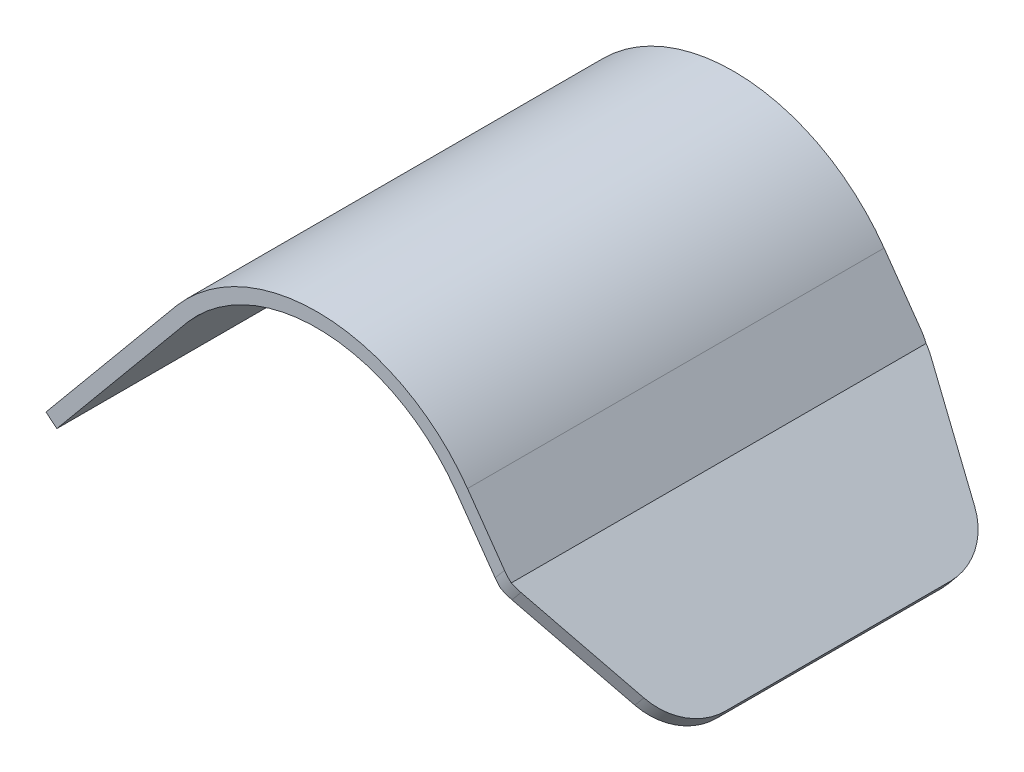
ISO-10303-21;
HEADER;
FILE_DESCRIPTION(('STEP AP214'),'2;1');
FILE_NAME('part.step','',(''),(''),'','','');
FILE_SCHEMA(('AUTOMOTIVE_DESIGN { 1 0 10303 214 1 1 1 1 }'));
ENDSEC;
DATA;
#1=APPLICATION_CONTEXT('core data for automotive mechanical design processes');
#2=APPLICATION_PROTOCOL_DEFINITION('international standard','automotive_design',2000,#1);
#3=PRODUCT_CONTEXT('',#1,'mechanical');
#4=PRODUCT('Part','Part','',(#3));
#5=PRODUCT_RELATED_PRODUCT_CATEGORY('part','',(#4));
#6=PRODUCT_DEFINITION_FORMATION('','',#4);
#7=PRODUCT_DEFINITION_CONTEXT('part definition',#1,'design');
#8=PRODUCT_DEFINITION('design','',#6,#7);
#9=PRODUCT_DEFINITION_SHAPE('','',#8);
#10=(LENGTH_UNIT() NAMED_UNIT(*) SI_UNIT(.MILLI.,.METRE.));
#11=(NAMED_UNIT(*) PLANE_ANGLE_UNIT() SI_UNIT($,.RADIAN.));
#12=(NAMED_UNIT(*) SI_UNIT($,.STERADIAN.) SOLID_ANGLE_UNIT());
#13=UNCERTAINTY_MEASURE_WITH_UNIT(LENGTH_MEASURE(1.E-05),#10,'distance_accuracy_value','');
#14=(GEOMETRIC_REPRESENTATION_CONTEXT(3) GLOBAL_UNCERTAINTY_ASSIGNED_CONTEXT((#13)) GLOBAL_UNIT_ASSIGNED_CONTEXT((#10,
#11,#12)) REPRESENTATION_CONTEXT('',''));
#15=CARTESIAN_POINT('',(0.,0.,0.));
#16=DIRECTION('',(0.,0.,1.));
#17=DIRECTION('',(1.,0.,0.));
#18=AXIS2_PLACEMENT_3D('',#15,#16,#17);
#19=CARTESIAN_POINT('',(98.2846711056519,73.4666673466549,-37.));
#20=DIRECTION('',(0.,0.,1.));
#21=DIRECTION('',(1.,0.,0.));
#22=AXIS2_PLACEMENT_3D('',#19,#20,#21);
#23=CYLINDRICAL_SURFACE('',#22,30.2286703263176);
#24=DIRECTION('',(0.,0.,1.));
#25=VECTOR('',#24,1.);
#26=CARTESIAN_POINT('',(122.974907994075,90.9069859243292,-37.));
#27=LINE('',#26,#25);
#28=CARTESIAN_POINT('',(122.974907994075,90.9069859243292,-37.));
#29=VERTEX_POINT('',#28);
#30=CARTESIAN_POINT('',(122.974907994075,90.9069859243292,37.));
#31=VERTEX_POINT('',#30);
#32=EDGE_CURVE('E420',#29,#31,#27,.T.);
#33=ORIENTED_EDGE('',*,*,#32,.T.);
#34=CARTESIAN_POINT('',(98.2846711056519,73.4666673466549,37.));
#35=DIRECTION('',(0.,0.,1.));
#36=DIRECTION('',(1.,0.,0.));
#37=AXIS2_PLACEMENT_3D('',#34,#35,#36);
#38=CIRCLE('',#37,30.2286703263176);
#39=CARTESIAN_POINT('',(75.3095561726378,93.1114275516558,37.));
#40=VERTEX_POINT('',#39);
#41=EDGE_CURVE('E385',#40,#31,#38,.F.);
#42=ORIENTED_EDGE('',*,*,#41,.F.);
#43=DIRECTION('',(0.,0.,1.));
#44=VECTOR('',#43,1.);
#45=CARTESIAN_POINT('',(75.3095561726378,93.1114275516558,-37.));
#46=LINE('',#45,#44);
#47=CARTESIAN_POINT('',(75.3095561726379,93.1114275516558,-37.));
#48=VERTEX_POINT('',#47);
#49=EDGE_CURVE('E263',#40,#48,#46,.F.);
#50=ORIENTED_EDGE('',*,*,#49,.T.);
#51=CARTESIAN_POINT('',(98.2846711056519,73.4666673466549,-37.));
#52=DIRECTION('',(0.,0.,1.));
#53=DIRECTION('',(1.,0.,0.));
#54=AXIS2_PLACEMENT_3D('',#51,#52,#53);
#55=CIRCLE('',#54,30.2286703263176);
#56=EDGE_CURVE('E272',#48,#29,#55,.F.);
#57=ORIENTED_EDGE('',*,*,#56,.T.);
#58=EDGE_LOOP('',(#33,#42,#50,#57));
#59=FACE_BOUND('',#58,.T.);
#60=ADVANCED_FACE('F112',(#59),#23,.F.);
#61=CARTESIAN_POINT('',(98.2846711056519,73.4666673466549,-37.));
#62=DIRECTION('',(0.,0.,-1.));
#63=DIRECTION('',(-1.,0.,0.));
#64=AXIS2_PLACEMENT_3D('',#61,#62,#63);
#65=PLANE('',#64);
#66=DIRECTION('',(0.576946269531751,-0.816782101954613,0.));
#67=VECTOR('',#66,1.);
#68=CARTESIAN_POINT('',(125.016863248961,92.3493515981586,-37.));
#69=LINE('',#68,#67);
#70=CARTESIAN_POINT('',(125.016863248961,92.3493515981586,-37.));
#71=VERTEX_POINT('',#70);
#72=CARTESIAN_POINT('',(131.584676674904,83.0513064619262,-37.));
#73=VERTEX_POINT('',#72);
#74=EDGE_CURVE('E267',#71,#73,#69,.T.);
#75=ORIENTED_EDGE('',*,*,#74,.T.);
#76=DIRECTION('',(0.638552902804792,0.769577929984725,0.));
#77=VECTOR('',#76,1.);
#78=CARTESIAN_POINT('',(129.685244994592,80.7621293330441,-37.));
#79=LINE('',#78,#77);
#80=CARTESIAN_POINT('',(129.931360316438,81.0587451953984,-37.));
#81=VERTEX_POINT('',#80);
#82=EDGE_CURVE('E329',#73,#81,#79,.F.);
#83=ORIENTED_EDGE('',*,*,#82,.T.);
#84=DIRECTION('',(0.576946269531751,-0.816782101954613,0.));
#85=VECTOR('',#84,1.);
#86=CARTESIAN_POINT('',(122.974907994075,90.9069859243292,-37.));
#87=LINE('',#86,#85);
#88=EDGE_CURVE('E435',#29,#81,#87,.T.);
#89=ORIENTED_EDGE('',*,*,#88,.F.);
#90=ORIENTED_EDGE('',*,*,#56,.F.);
#91=DIRECTION('',(0.638552902804786,0.76957792998473,0.));
#92=VECTOR('',#91,1.);
#93=CARTESIAN_POINT('',(52.0598583226345,65.0911111995023,-37.));
#94=LINE('',#93,#92);
#95=CARTESIAN_POINT('',(52.0598583226345,65.0911111995023,-37.));
#96=VERTEX_POINT('',#95);
#97=EDGE_CURVE('E253',#96,#48,#94,.T.);
#98=ORIENTED_EDGE('',*,*,#97,.F.);
#99=DIRECTION('',(-0.769577929984731,0.638552902804785,0.));
#100=VECTOR('',#99,1.);
#101=CARTESIAN_POINT('',(52.0598583226345,65.0911111995023,-37.));
#102=LINE('',#101,#100);
#103=CARTESIAN_POINT('',(50.1359134976727,66.6874934565142,-37.));
#104=VERTEX_POINT('',#103);
#105=EDGE_CURVE('E235',#96,#104,#102,.T.);
#106=ORIENTED_EDGE('',*,*,#105,.T.);
#107=DIRECTION('',(0.638552902804786,0.76957792998473,0.));
#108=VECTOR('',#107,1.);
#109=CARTESIAN_POINT('',(50.1359134976727,66.6874934565142,-37.));
#110=LINE('',#109,#108);
#111=CARTESIAN_POINT('',(72.8027229224496,94.005318181541,-37.));
#112=VERTEX_POINT('',#111);
#113=EDGE_CURVE('E250',#104,#112,#110,.T.);
#114=ORIENTED_EDGE('',*,*,#113,.T.);
#115=CARTESIAN_POINT('',(72.8027229224496,94.0053181815411,-37.));
#116=DIRECTION('',(0.638552902804781,0.769577929984734,0.));
#117=VECTOR('',#116,1.);
#118=LINE('',#115,#117);
#119=CARTESIAN_POINT('',(73.3971896058036,94.7217638160546,-37.));
#120=VERTEX_POINT('',#119);
#121=EDGE_CURVE('E282',#112,#120,#118,.T.);
#122=ORIENTED_EDGE('',*,*,#121,.T.);
#123=CARTESIAN_POINT('',(98.2846711056519,73.4666673466549,-37.));
#124=DIRECTION('',(0.,0.,-1.));
#125=DIRECTION('',(1.,0.,0.));
#126=AXIS2_PLACEMENT_3D('',#123,#124,#125);
#127=CIRCLE('',#126,32.7286703263176);
#128=EDGE_CURVE('E269',#120,#71,#127,.T.);
#129=ORIENTED_EDGE('',*,*,#128,.T.);
#130=EDGE_LOOP('',(#75,#83,#89,#90,#98,#106,#114,#122,#129));
#131=FACE_BOUND('',#130,.T.);
#132=ADVANCED_FACE('F249',(#131),#65,.T.);
#133=CARTESIAN_POINT('',(152.209243945667,62.0729695318179,-37.));
#134=DIRECTION('',(-0.638552902804792,-0.769577929984725,0.));
#135=DIRECTION('',(0.769577929984725,-0.638552902804792,0.));
#136=AXIS2_PLACEMENT_3D('',#133,#134,#135);
#137=PLANE('',#136);
#138=DIRECTION('',(0.,0.,1.));
#139=VECTOR('',#138,1.);
#140=CARTESIAN_POINT('',(130.786083181693,79.8487151192221,-37.));
#141=LINE('',#140,#139);
#142=CARTESIAN_POINT('',(130.786083181693,79.848715119222,-36.8971627126065));
#143=VERTEX_POINT('',#142);
#144=CARTESIAN_POINT('',(130.786083181693,79.8487151192221,36.8971627126065));
#145=VERTEX_POINT('',#144);
#146=EDGE_CURVE('E377',#143,#145,#141,.T.);
#147=ORIENTED_EDGE('',*,*,#146,.F.);
#148=CARTESIAN_POINT('',(129.685244994592,80.7621293330441,-27.));
#149=DIRECTION('',(-0.638552902804792,-0.769577929984725,0.));
#150=DIRECTION('',(0.769577929984725,-0.638552902804792,0.));
#151=AXIS2_PLACEMENT_3D('',#148,#149,#150);
#152=CIRCLE('',#151,10.);
#153=CARTESIAN_POINT('',(132.314663472216,78.5803843321068,-36.398199147731));
#154=VERTEX_POINT('',#153);
#155=EDGE_CURVE('E340',#143,#154,#152,.T.);
#156=ORIENTED_EDGE('',*,*,#155,.T.);
#157=DIRECTION('',(-0.7232646645695,0.600124734692113,-0.341670203260234));
#158=VECTOR('',#157,1.);
#159=CARTESIAN_POINT('',(149.738064096123,64.1234169326554,-28.1673852779589));
#160=LINE('',#159,#158);
#161=CARTESIAN_POINT('',(147.142883123444,66.2767535589286,-29.3933486823234));
#162=VERTEX_POINT('',#161);
#163=EDGE_CURVE('E366',#162,#154,#160,.T.);
#164=ORIENTED_EDGE('',*,*,#163,.F.);
#165=CARTESIAN_POINT('',(144.51346464582,68.4584985598659,-19.9951495345924));
#166=DIRECTION('',(-0.638552902804792,-0.769577929984725,0.));
#167=DIRECTION('',(0.769577929984725,-0.638552902804792,0.));
#168=AXIS2_PLACEMENT_3D('',#165,#166,#167);
#169=CIRCLE('',#168,10.);
#170=CARTESIAN_POINT('',(152.209243945667,62.0729695318179,-19.9951495345924));
#171=VERTEX_POINT('',#170);
#172=EDGE_CURVE('E133',#162,#171,#169,.T.);
#173=ORIENTED_EDGE('',*,*,#172,.T.);
#174=DIRECTION('',(0.,0.,1.));
#175=VECTOR('',#174,1.);
#176=CARTESIAN_POINT('',(152.209243945667,62.0729695318179,-37.));
#177=LINE('',#176,#175);
#178=CARTESIAN_POINT('',(152.209243945667,62.0729695318179,19.9951495345924));
#179=VERTEX_POINT('',#178);
#180=EDGE_CURVE('E434',#171,#179,#177,.T.);
#181=ORIENTED_EDGE('',*,*,#180,.T.);
#182=CARTESIAN_POINT('',(144.51346464582,68.4584985598659,19.9951495345924));
#183=DIRECTION('',(-0.638552902804792,-0.769577929984725,0.));
#184=DIRECTION('',(0.769577929984725,-0.638552902804792,0.));
#185=AXIS2_PLACEMENT_3D('',#182,#183,#184);
#186=CIRCLE('',#185,10.);
#187=CARTESIAN_POINT('',(147.142883123444,66.2767535589286,29.3933486823234));
#188=VERTEX_POINT('',#187);
#189=EDGE_CURVE('E335',#179,#188,#186,.T.);
#190=ORIENTED_EDGE('',*,*,#189,.T.);
#191=DIRECTION('',(0.7232646645695,-0.600124734692113,-0.341670203260234));
#192=VECTOR('',#191,1.);
#193=CARTESIAN_POINT('',(168.024794982749,48.9501061664581,19.5287342210631));
#194=LINE('',#193,#192);
#195=CARTESIAN_POINT('',(132.314663472216,78.5803843321068,36.398199147731));
#196=VERTEX_POINT('',#195);
#197=EDGE_CURVE('E355',#196,#188,#194,.T.);
#198=ORIENTED_EDGE('',*,*,#197,.F.);
#199=CARTESIAN_POINT('',(129.685244994592,80.7621293330441,27.));
#200=DIRECTION('',(-0.638552902804792,-0.769577929984725,0.));
#201=DIRECTION('',(0.769577929984725,-0.638552902804792,0.));
#202=AXIS2_PLACEMENT_3D('',#199,#200,#201);
#203=CIRCLE('',#202,10.);
#204=EDGE_CURVE('E338',#196,#145,#203,.T.);
#205=ORIENTED_EDGE('',*,*,#204,.T.);
#206=EDGE_LOOP('',(#147,#156,#164,#173,#181,#190,#198,#205));
#207=FACE_BOUND('',#206,.T.);
#208=ADVANCED_FACE('F363',(#207),#137,.T.);
#209=CARTESIAN_POINT('',(122.974907994075,90.9069859243292,-37.));
#210=DIRECTION('',(-0.816782101954613,-0.576946269531751,0.));
#211=DIRECTION('',(0.576946269531751,-0.816782101954613,0.));
#212=AXIS2_PLACEMENT_3D('',#209,#210,#211);
#213=PLANE('',#212);
#214=ORIENTED_EDGE('',*,*,#88,.T.);
#215=CARTESIAN_POINT('',(129.931360316438,81.0587451953984,-27.));
#216=DIRECTION('',(-0.816782101954613,-0.576946269531751,0.));
#217=DIRECTION('',(0.576946269531751,-0.816782101954613,0.));
#218=AXIS2_PLACEMENT_3D('',#215,#216,#217);
#219=ELLIPSE('',#218,10.3566445392597,10.);
#220=EDGE_CURVE('E333',#81,#143,#219,.T.);
#221=ORIENTED_EDGE('',*,*,#220,.T.);
#222=ORIENTED_EDGE('',*,*,#146,.T.);
#223=CARTESIAN_POINT('',(129.931360316438,81.0587451953984,27.));
#224=DIRECTION('',(-0.816782101954613,-0.576946269531751,0.));
#225=DIRECTION('',(-0.576946269531751,0.816782101954613,0.));
#226=AXIS2_PLACEMENT_3D('',#223,#224,#225);
#227=ELLIPSE('',#226,10.3566445392597,10.);
#228=CARTESIAN_POINT('',(129.931360316438,81.0587451953984,37.));
#229=VERTEX_POINT('',#228);
#230=EDGE_CURVE('E331',#145,#229,#227,.T.);
#231=ORIENTED_EDGE('',*,*,#230,.T.);
#232=DIRECTION('',(0.576946269531751,-0.816782101954613,0.));
#233=VECTOR('',#232,1.);
#234=CARTESIAN_POINT('',(122.974907994075,90.9069859243292,37.));
#235=LINE('',#234,#233);
#236=EDGE_CURVE('E376',#31,#229,#235,.T.);
#237=ORIENTED_EDGE('',*,*,#236,.F.);
#238=ORIENTED_EDGE('',*,*,#32,.F.);
#239=EDGE_LOOP('',(#214,#221,#222,#231,#237,#238));
#240=FACE_BOUND('',#239,.T.);
#241=ADVANCED_FACE('F300',(#240),#213,.T.);
#242=CARTESIAN_POINT('',(98.2846711056519,73.4666673466549,-37.));
#243=DIRECTION('',(0.,0.,1.));
#244=DIRECTION('',(1.,0.,0.));
#245=AXIS2_PLACEMENT_3D('',#242,#243,#244);
#246=CYLINDRICAL_SURFACE('',#245,32.7286703263176);
#247=ORIENTED_EDGE('',*,*,#128,.F.);
#248=ORIENTED_EDGE('',*,*,#121,.F.);
#249=DIRECTION('',(0.,0.,1.));
#250=VECTOR('',#249,1.);
#251=CARTESIAN_POINT('',(72.8027229224496,94.0053181815411,-37.));
#252=LINE('',#251,#250);
#253=CARTESIAN_POINT('',(72.8027229224496,94.0053181815411,37.));
#254=VERTEX_POINT('',#253);
#255=EDGE_CURVE('E257',#112,#254,#252,.T.);
#256=ORIENTED_EDGE('',*,*,#255,.T.);
#257=CARTESIAN_POINT('',(98.2846711056519,73.4666673466549,37.));
#258=DIRECTION('',(0.,0.,-1.));
#259=DIRECTION('',(-0.778581834493654,0.62754308776091,0.));
#260=AXIS2_PLACEMENT_3D('',#257,#258,#259);
#261=CIRCLE('',#260,32.7286703263176);
#262=CARTESIAN_POINT('',(73.3971896058036,94.7217638160546,37.));
#263=VERTEX_POINT('',#262);
#264=EDGE_CURVE('E386',#254,#263,#261,.T.);
#265=ORIENTED_EDGE('',*,*,#264,.T.);
#266=CARTESIAN_POINT('',(98.2846711056519,73.4666673466549,37.));
#267=DIRECTION('',(0.,0.,-1.));
#268=DIRECTION('',(1.,0.,0.));
#269=AXIS2_PLACEMENT_3D('',#266,#267,#268);
#270=CIRCLE('',#269,32.7286703263176);
#271=CARTESIAN_POINT('',(125.016863248961,92.3493515981586,37.));
#272=VERTEX_POINT('',#271);
#273=EDGE_CURVE('E388',#263,#272,#270,.T.);
#274=ORIENTED_EDGE('',*,*,#273,.T.);
#275=DIRECTION('',(0.,0.,1.));
#276=VECTOR('',#275,1.);
#277=CARTESIAN_POINT('',(125.016863248961,92.3493515981586,-37.));
#278=LINE('',#277,#276);
#279=EDGE_CURVE('E421',#71,#272,#278,.T.);
#280=ORIENTED_EDGE('',*,*,#279,.F.);
#281=EDGE_LOOP('',(#247,#248,#256,#265,#274,#280));
#282=FACE_BOUND('',#281,.T.);
#283=ADVANCED_FACE('F289',(#282),#246,.T.);
#284=CARTESIAN_POINT('',(125.016863248961,92.3493515981586,-37.));
#285=DIRECTION('',(-0.816782101954613,-0.576946269531751,0.));
#286=DIRECTION('',(0.576946269531751,-0.816782101954613,0.));
#287=AXIS2_PLACEMENT_3D('',#284,#285,#286);
#288=PLANE('',#287);
#289=DIRECTION('',(0.,0.,1.));
#290=VECTOR('',#289,1.);
#291=CARTESIAN_POINT('',(132.63712342813,81.5613589283489,-37.));
#292=LINE('',#291,#290);
#293=CARTESIAN_POINT('',(132.63712342813,81.5613589283489,-36.8436601814366));
#294=VERTEX_POINT('',#293);
#295=CARTESIAN_POINT('',(132.63712342813,81.5613589283489,36.8436601814366));
#296=VERTEX_POINT('',#295);
#297=EDGE_CURVE('E423',#294,#296,#292,.T.);
#298=ORIENTED_EDGE('',*,*,#297,.F.);
#299=CARTESIAN_POINT('',(131.584676674904,83.0513064619262,-27.));
#300=DIRECTION('',(-0.816782101954613,-0.576946269531751,0.));
#301=DIRECTION('',(0.576946269531751,-0.816782101954613,0.));
#302=AXIS2_PLACEMENT_3D('',#299,#300,#301);
#303=ELLIPSE('',#302,10.3566445392597,10.);
#304=EDGE_CURVE('E327',#294,#73,#303,.F.);
#305=ORIENTED_EDGE('',*,*,#304,.T.);
#306=ORIENTED_EDGE('',*,*,#74,.F.);
#307=ORIENTED_EDGE('',*,*,#279,.T.);
#308=DIRECTION('',(0.576946269531751,-0.816782101954613,0.));
#309=VECTOR('',#308,1.);
#310=CARTESIAN_POINT('',(125.016863248961,92.3493515981586,37.));
#311=LINE('',#310,#309);
#312=CARTESIAN_POINT('',(131.584676674904,83.0513064619262,37.));
#313=VERTEX_POINT('',#312);
#314=EDGE_CURVE('E243',#272,#313,#311,.T.);
#315=ORIENTED_EDGE('',*,*,#314,.T.);
#316=CARTESIAN_POINT('',(131.584676674904,83.0513064619262,27.));
#317=DIRECTION('',(-0.816782101954613,-0.576946269531751,0.));
#318=DIRECTION('',(-0.576946269531751,0.816782101954613,0.));
#319=AXIS2_PLACEMENT_3D('',#316,#317,#318);
#320=ELLIPSE('',#319,10.3566445392597,10.);
#321=EDGE_CURVE('E325',#313,#296,#320,.F.);
#322=ORIENTED_EDGE('',*,*,#321,.T.);
#323=EDGE_LOOP('',(#298,#305,#306,#307,#315,#322));
#324=FACE_BOUND('',#323,.T.);
#325=ADVANCED_FACE('F299',(#324),#288,.F.);
#326=CARTESIAN_POINT('',(153.805626202679,63.9969143567798,-37.));
#327=DIRECTION('',(-0.638552902804792,-0.769577929984725,0.));
#328=DIRECTION('',(0.769577929984725,-0.638552902804792,0.));
#329=AXIS2_PLACEMENT_3D('',#326,#327,#328);
#330=PLANE('',#329);
#331=DIRECTION('',(0.7232646645695,-0.600124734692113,0.341670203260233));
#332=VECTOR('',#331,1.);
#333=CARTESIAN_POINT('',(132.63712342813,81.5613589283489,-37.));
#334=LINE('',#333,#332);
#335=CARTESIAN_POINT('',(133.911045729228,80.5043291570686,-36.398199147731));
#336=VERTEX_POINT('',#335);
#337=CARTESIAN_POINT('',(148.739265380456,68.2006983838904,-29.3933486823234));
#338=VERTEX_POINT('',#337);
#339=EDGE_CURVE('E455',#336,#338,#334,.T.);
#340=ORIENTED_EDGE('',*,*,#339,.F.);
#341=CARTESIAN_POINT('',(131.281627251604,82.6860741580059,-27.));
#342=DIRECTION('',(-0.638552902804792,-0.769577929984725,0.));
#343=DIRECTION('',(0.769577929984725,-0.638552902804792,0.));
#344=AXIS2_PLACEMENT_3D('',#341,#342,#343);
#345=CIRCLE('',#344,10.);
#346=EDGE_CURVE('E323',#336,#294,#345,.F.);
#347=ORIENTED_EDGE('',*,*,#346,.T.);
#348=ORIENTED_EDGE('',*,*,#297,.T.);
#349=CARTESIAN_POINT('',(131.281627251604,82.6860741580059,27.));
#350=DIRECTION('',(-0.638552902804792,-0.769577929984725,0.));
#351=DIRECTION('',(0.769577929984725,-0.638552902804792,0.));
#352=AXIS2_PLACEMENT_3D('',#349,#350,#351);
#353=CIRCLE('',#352,10.);
#354=CARTESIAN_POINT('',(133.911045729228,80.5043291570686,36.398199147731));
#355=VERTEX_POINT('',#354);
#356=EDGE_CURVE('E321',#296,#355,#353,.F.);
#357=ORIENTED_EDGE('',*,*,#356,.T.);
#358=DIRECTION('',(-0.7232646645695,0.600124734692113,0.341670203260233));
#359=VECTOR('',#358,1.);
#360=CARTESIAN_POINT('',(132.63712342813,81.5613589283489,37.));
#361=LINE('',#360,#359);
#362=CARTESIAN_POINT('',(148.739265380456,68.2006983838904,29.3933486823234));
#363=VERTEX_POINT('',#362);
#364=EDGE_CURVE('E358',#363,#355,#361,.T.);
#365=ORIENTED_EDGE('',*,*,#364,.F.);
#366=CARTESIAN_POINT('',(146.109846902832,70.3824433848277,19.9951495345924));
#367=DIRECTION('',(-0.638552902804792,-0.769577929984725,0.));
#368=DIRECTION('',(0.769577929984725,-0.638552902804792,0.));
#369=AXIS2_PLACEMENT_3D('',#366,#367,#368);
#370=CIRCLE('',#369,10.);
#371=CARTESIAN_POINT('',(153.805626202679,63.9969143567798,19.9951495345924));
#372=VERTEX_POINT('',#371);
#373=EDGE_CURVE('E317',#363,#372,#370,.F.);
#374=ORIENTED_EDGE('',*,*,#373,.T.);
#375=DIRECTION('',(0.,0.,1.));
#376=VECTOR('',#375,1.);
#377=CARTESIAN_POINT('',(153.805626202679,63.9969143567798,-37.));
#378=LINE('',#377,#376);
#379=CARTESIAN_POINT('',(153.805626202679,63.9969143567798,-19.9951495345924));
#380=VERTEX_POINT('',#379);
#381=EDGE_CURVE('E430',#380,#372,#378,.T.);
#382=ORIENTED_EDGE('',*,*,#381,.F.);
#383=CARTESIAN_POINT('',(146.109846902832,70.3824433848277,-19.9951495345924));
#384=DIRECTION('',(-0.638552902804792,-0.769577929984725,0.));
#385=DIRECTION('',(0.769577929984725,-0.638552902804792,0.));
#386=AXIS2_PLACEMENT_3D('',#383,#384,#385);
#387=CIRCLE('',#386,10.);
#388=EDGE_CURVE('E319',#380,#338,#387,.F.);
#389=ORIENTED_EDGE('',*,*,#388,.T.);
#390=EDGE_LOOP('',(#340,#347,#348,#357,#365,#374,#382,#389));
#391=FACE_BOUND('',#390,.T.);
#392=ADVANCED_FACE('F454',(#391),#330,.F.);
#393=CARTESIAN_POINT('',(153.805626202679,63.9969143567798,-37.));
#394=DIRECTION('',(-0.769577929984726,0.638552902804791,0.));
#395=DIRECTION('',(-0.638552902804791,-0.769577929984726,0.));
#396=AXIS2_PLACEMENT_3D('',#393,#394,#395);
#397=PLANE('',#396);
#398=ORIENTED_EDGE('',*,*,#180,.F.);
#399=DIRECTION('',(0.638552902804791,0.769577929984726,0.));
#400=VECTOR('',#399,1.);
#401=CARTESIAN_POINT('',(153.805626202679,63.9969143567798,-19.9951495345924));
#402=LINE('',#401,#400);
#403=EDGE_CURVE('E12',#171,#380,#402,.T.);
#404=ORIENTED_EDGE('',*,*,#403,.T.);
#405=ORIENTED_EDGE('',*,*,#381,.T.);
#406=DIRECTION('',(0.638552902804791,0.769577929984726,0.));
#407=VECTOR('',#406,1.);
#408=CARTESIAN_POINT('',(153.805626202679,63.9969143567797,19.9951495345924));
#409=LINE('',#408,#407);
#410=EDGE_CURVE('E120',#372,#179,#409,.F.);
#411=ORIENTED_EDGE('',*,*,#410,.T.);
#412=EDGE_LOOP('',(#398,#404,#405,#411));
#413=FACE_BOUND('',#412,.T.);
#414=ADVANCED_FACE('F541',(#413),#397,.F.);
#415=CARTESIAN_POINT('',(50.1359134976727,66.6874934565142,37.));
#416=DIRECTION('',(-0.76957792998473,0.638552902804786,0.));
#417=DIRECTION('',(-0.638552902804786,-0.76957792998473,0.));
#418=AXIS2_PLACEMENT_3D('',#415,#416,#417);
#419=PLANE('',#418);
#420=CARTESIAN_POINT('',(58.1808907012102,76.3832240308774,-1.55338666496028));
#421=DIRECTION('',(-0.76957792998473,0.638552902804786,0.));
#422=DIRECTION('',(-0.638552902804786,-0.76957792998473,0.));
#423=AXIS2_PLACEMENT_3D('',#420,#421,#422);
#424=CIRCLE('',#423,1.70000000000001);
#425=CARTESIAN_POINT('',(57.095350766442,75.0749415499034,-1.55338666496028));
#426=VERTEX_POINT('',#425);
#427=EDGE_CURVE('E259',#426,#426,#424,.T.);
#428=ORIENTED_EDGE('',*,*,#427,.F.);
#429=EDGE_LOOP('',(#428));
#430=FACE_BOUND('',#429,.T.);
#431=CARTESIAN_POINT('',(61.8353722373306,80.7875706768354,-9.45700491751469));
#432=DIRECTION('',(-0.76957792998473,0.638552902804786,0.));
#433=DIRECTION('',(-0.638552902804786,-0.76957792998473,0.));
#434=AXIS2_PLACEMENT_3D('',#431,#432,#433);
#435=CIRCLE('',#434,1.69999999999999);
#436=CARTESIAN_POINT('',(60.7498323025624,79.4792881958613,-9.45700491751469));
#437=VERTEX_POINT('',#436);
#438=EDGE_CURVE('E489',#437,#437,#435,.T.);
#439=ORIENTED_EDGE('',*,*,#438,.F.);
#440=EDGE_LOOP('',(#439));
#441=FACE_BOUND('',#440,.T.);
#442=CARTESIAN_POINT('',(65.1296341076054,84.7577839822923,-1.45229617633346));
#443=DIRECTION('',(-0.76957792998473,0.638552902804786,0.));
#444=DIRECTION('',(-0.638552902804786,-0.76957792998473,0.));
#445=AXIS2_PLACEMENT_3D('',#442,#443,#444);
#446=CIRCLE('',#445,1.69999999999999);
#447=CARTESIAN_POINT('',(64.0440941728372,83.4495015013183,-1.45229617633346));
#448=VERTEX_POINT('',#447);
#449=EDGE_CURVE('E486',#448,#448,#446,.T.);
#450=ORIENTED_EDGE('',*,*,#449,.F.);
#451=EDGE_LOOP('',(#450));
#452=FACE_BOUND('',#451,.T.);
#453=CARTESIAN_POINT('',(61.5167554021311,80.4035766750634,6.55241256484776));
#454=DIRECTION('',(-0.76957792998473,0.638552902804786,0.));
#455=DIRECTION('',(-0.638552902804786,-0.76957792998473,0.));
#456=AXIS2_PLACEMENT_3D('',#453,#454,#455);
#457=CIRCLE('',#456,1.69999999999999);
#458=CARTESIAN_POINT('',(60.431215467363,79.0952941940894,6.55241256484776));
#459=VERTEX_POINT('',#458);
#460=EDGE_CURVE('E483',#459,#459,#457,.T.);
#461=ORIENTED_EDGE('',*,*,#460,.F.);
#462=EDGE_LOOP('',(#461));
#463=FACE_BOUND('',#462,.T.);
#464=CARTESIAN_POINT('',(54.8450260002892,72.3628713866914,-9.65918589476832));
#465=DIRECTION('',(-0.76957792998473,0.638552902804786,0.));
#466=DIRECTION('',(-0.638552902804786,-0.76957792998473,0.));
#467=AXIS2_PLACEMENT_3D('',#464,#465,#466);
#468=CIRCLE('',#467,1.70000000000001);
#469=CARTESIAN_POINT('',(53.7594860655211,71.0545889057174,-9.65918589476832));
#470=VERTEX_POINT('',#469);
#471=EDGE_CURVE('E480',#470,#470,#468,.T.);
#472=ORIENTED_EDGE('',*,*,#471,.F.);
#473=EDGE_LOOP('',(#472));
#474=FACE_BOUND('',#473,.T.);
#475=CARTESIAN_POINT('',(68.4238959778802,88.7279972877493,6.55241256484777));
#476=DIRECTION('',(-0.76957792998473,0.638552902804786,0.));
#477=DIRECTION('',(-0.638552902804786,-0.76957792998473,0.));
#478=AXIS2_PLACEMENT_3D('',#475,#476,#477);
#479=CIRCLE('',#478,1.70000000000001);
#480=CARTESIAN_POINT('',(67.3383560431121,87.4197148067752,6.55241256484777));
#481=VERTEX_POINT('',#480);
#482=EDGE_CURVE('E477',#481,#481,#479,.T.);
#483=ORIENTED_EDGE('',*,*,#482,.F.);
#484=EDGE_LOOP('',(#483));
#485=FACE_BOUND('',#484,.T.);
#486=ORIENTED_EDGE('',*,*,#255,.F.);
#487=ORIENTED_EDGE('',*,*,#113,.F.);
#488=DIRECTION('',(0.,0.,-1.));
#489=VECTOR('',#488,1.);
#490=CARTESIAN_POINT('',(50.1359134976727,66.6874934565142,37.));
#491=LINE('',#490,#489);
#492=CARTESIAN_POINT('',(50.1359134976727,66.6874934565142,37.));
#493=VERTEX_POINT('',#492);
#494=EDGE_CURVE('E232',#493,#104,#491,.T.);
#495=ORIENTED_EDGE('',*,*,#494,.F.);
#496=DIRECTION('',(0.638552902804786,0.76957792998473,0.));
#497=VECTOR('',#496,1.);
#498=CARTESIAN_POINT('',(50.1359134976727,66.6874934565142,37.));
#499=LINE('',#498,#497);
#500=EDGE_CURVE('E495',#493,#254,#499,.T.);
#501=ORIENTED_EDGE('',*,*,#500,.T.);
#502=EDGE_LOOP('',(#486,#487,#495,#501));
#503=FACE_BOUND('',#502,.T.);
#504=ADVANCED_FACE('F256',(#430,#441,#452,#463,#474,#485,#503),#419,.T.);
#505=CARTESIAN_POINT('',(98.2846711056519,73.4666673466549,37.));
#506=DIRECTION('',(0.,0.,-1.));
#507=DIRECTION('',(-1.,0.,0.));
#508=AXIS2_PLACEMENT_3D('',#505,#506,#507);
#509=PLANE('',#508);
#510=ORIENTED_EDGE('',*,*,#236,.T.);
#511=DIRECTION('',(0.638552902804792,0.769577929984725,0.));
#512=VECTOR('',#511,1.);
#513=CARTESIAN_POINT('',(113.296558606799,61.0106392214376,37.));
#514=LINE('',#513,#512);
#515=EDGE_CURVE('E342',#229,#313,#514,.T.);
#516=ORIENTED_EDGE('',*,*,#515,.T.);
#517=ORIENTED_EDGE('',*,*,#314,.F.);
#518=ORIENTED_EDGE('',*,*,#273,.F.);
#519=ORIENTED_EDGE('',*,*,#264,.F.);
#520=ORIENTED_EDGE('',*,*,#500,.F.);
#521=DIRECTION('',(-0.769577929984731,0.638552902804785,0.));
#522=VECTOR('',#521,1.);
#523=CARTESIAN_POINT('',(52.0598583226345,65.0911111995023,37.));
#524=LINE('',#523,#522);
#525=CARTESIAN_POINT('',(52.0598583226345,65.0911111995023,37.));
#526=VERTEX_POINT('',#525);
#527=EDGE_CURVE('E238',#526,#493,#524,.T.);
#528=ORIENTED_EDGE('',*,*,#527,.F.);
#529=DIRECTION('',(0.638552902804786,0.76957792998473,0.));
#530=VECTOR('',#529,1.);
#531=CARTESIAN_POINT('',(52.0598583226345,65.0911111995023,37.));
#532=LINE('',#531,#530);
#533=EDGE_CURVE('E254',#526,#40,#532,.T.);
#534=ORIENTED_EDGE('',*,*,#533,.T.);
#535=ORIENTED_EDGE('',*,*,#41,.T.);
#536=EDGE_LOOP('',(#510,#516,#517,#518,#519,#520,#528,#534,#535));
#537=FACE_BOUND('',#536,.T.);
#538=ADVANCED_FACE('F380',(#537),#509,.F.);
#539=CARTESIAN_POINT('',(52.0598583226345,65.0911111995023,37.));
#540=DIRECTION('',(-0.76957792998473,0.638552902804786,0.));
#541=DIRECTION('',(-0.638552902804786,-0.76957792998473,0.));
#542=AXIS2_PLACEMENT_3D('',#539,#540,#541);
#543=PLANE('',#542);
#544=CARTESIAN_POINT('',(60.104835526172,74.7868417738654,-1.55338666496028));
#545=DIRECTION('',(0.76957792998473,-0.638552902804786,0.));
#546=DIRECTION('',(0.638552902804786,0.76957792998473,0.));
#547=AXIS2_PLACEMENT_3D('',#544,#545,#546);
#548=CIRCLE('',#547,1.70000000000001);
#549=CARTESIAN_POINT('',(61.1903754609401,76.0951242548395,-1.55338666496028));
#550=VERTEX_POINT('',#549);
#551=EDGE_CURVE('E462',#550,#550,#548,.T.);
#552=ORIENTED_EDGE('',*,*,#551,.F.);
#553=EDGE_LOOP('',(#552));
#554=FACE_BOUND('',#553,.T.);
#555=CARTESIAN_POINT('',(63.7593170622924,79.1911884198234,-9.45700491751469));
#556=DIRECTION('',(0.76957792998473,-0.638552902804786,0.));
#557=DIRECTION('',(0.638552902804786,0.76957792998473,0.));
#558=AXIS2_PLACEMENT_3D('',#555,#556,#557);
#559=CIRCLE('',#558,1.69999999999999);
#560=CARTESIAN_POINT('',(64.8448569970605,80.4994709007974,-9.45700491751469));
#561=VERTEX_POINT('',#560);
#562=EDGE_CURVE('E463',#561,#561,#559,.T.);
#563=ORIENTED_EDGE('',*,*,#562,.F.);
#564=EDGE_LOOP('',(#563));
#565=FACE_BOUND('',#564,.T.);
#566=CARTESIAN_POINT('',(67.0535789325672,83.1614017252803,-1.45229617633346));
#567=DIRECTION('',(0.76957792998473,-0.638552902804786,0.));
#568=DIRECTION('',(0.638552902804786,0.76957792998473,0.));
#569=AXIS2_PLACEMENT_3D('',#566,#567,#568);
#570=CIRCLE('',#569,1.69999999999999);
#571=CARTESIAN_POINT('',(68.1391188673354,84.4696842062544,-1.45229617633346));
#572=VERTEX_POINT('',#571);
#573=EDGE_CURVE('E466',#572,#572,#570,.T.);
#574=ORIENTED_EDGE('',*,*,#573,.F.);
#575=EDGE_LOOP('',(#574));
#576=FACE_BOUND('',#575,.T.);
#577=CARTESIAN_POINT('',(63.4407002270929,78.8071944180515,6.55241256484776));
#578=DIRECTION('',(0.76957792998473,-0.638552902804786,0.));
#579=DIRECTION('',(0.638552902804786,0.76957792998473,0.));
#580=AXIS2_PLACEMENT_3D('',#577,#578,#579);
#581=CIRCLE('',#580,1.69999999999999);
#582=CARTESIAN_POINT('',(64.5262401618611,80.1154768990255,6.55241256484776));
#583=VERTEX_POINT('',#582);
#584=EDGE_CURVE('E469',#583,#583,#581,.T.);
#585=ORIENTED_EDGE('',*,*,#584,.F.);
#586=EDGE_LOOP('',(#585));
#587=FACE_BOUND('',#586,.T.);
#588=CARTESIAN_POINT('',(56.7689708252511,70.7664891296795,-9.65918589476832));
#589=DIRECTION('',(0.76957792998473,-0.638552902804786,0.));
#590=DIRECTION('',(0.638552902804786,0.76957792998473,0.));
#591=AXIS2_PLACEMENT_3D('',#588,#589,#590);
#592=CIRCLE('',#591,1.70000000000001);
#593=CARTESIAN_POINT('',(57.8545107600192,72.0747716106535,-9.65918589476832));
#594=VERTEX_POINT('',#593);
#595=EDGE_CURVE('E451',#594,#594,#592,.T.);
#596=ORIENTED_EDGE('',*,*,#595,.F.);
#597=EDGE_LOOP('',(#596));
#598=FACE_BOUND('',#597,.T.);
#599=CARTESIAN_POINT('',(70.3478408028421,87.1316150307373,6.55241256484777));
#600=DIRECTION('',(0.76957792998473,-0.638552902804786,0.));
#601=DIRECTION('',(0.638552902804786,0.76957792998473,0.));
#602=AXIS2_PLACEMENT_3D('',#599,#600,#601);
#603=CIRCLE('',#602,1.70000000000001);
#604=CARTESIAN_POINT('',(71.4333807376102,88.4398975117114,6.55241256484777));
#605=VERTEX_POINT('',#604);
#606=EDGE_CURVE('E472',#605,#605,#603,.T.);
#607=ORIENTED_EDGE('',*,*,#606,.F.);
#608=EDGE_LOOP('',(#607));
#609=FACE_BOUND('',#608,.T.);
#610=ORIENTED_EDGE('',*,*,#49,.F.);
#611=ORIENTED_EDGE('',*,*,#533,.F.);
#612=DIRECTION('',(0.,0.,-1.));
#613=VECTOR('',#612,1.);
#614=CARTESIAN_POINT('',(52.0598583226345,65.0911111995023,37.));
#615=LINE('',#614,#613);
#616=EDGE_CURVE('E244',#526,#96,#615,.T.);
#617=ORIENTED_EDGE('',*,*,#616,.T.);
#618=ORIENTED_EDGE('',*,*,#97,.T.);
#619=EDGE_LOOP('',(#610,#611,#617,#618));
#620=FACE_BOUND('',#619,.T.);
#621=ADVANCED_FACE('F406',(#554,#565,#576,#587,#598,#609,#620),#543,.F.);
#622=CARTESIAN_POINT('',(52.0598583226345,65.0911111995023,37.));
#623=DIRECTION('',(-0.638552902804785,-0.769577929984731,0.));
#624=DIRECTION('',(0.769577929984731,-0.638552902804785,0.));
#625=AXIS2_PLACEMENT_3D('',#622,#623,#624);
#626=PLANE('',#625);
#627=ORIENTED_EDGE('',*,*,#494,.T.);
#628=ORIENTED_EDGE('',*,*,#105,.F.);
#629=ORIENTED_EDGE('',*,*,#616,.F.);
#630=ORIENTED_EDGE('',*,*,#527,.T.);
#631=EDGE_LOOP('',(#627,#628,#629,#630));
#632=FACE_BOUND('',#631,.T.);
#633=ADVANCED_FACE('F234',(#632),#626,.T.);
#634=CARTESIAN_POINT('',(52.6475484131933,101.818331795247,6.55241256484777));
#635=DIRECTION('',(0.76957792998473,-0.638552902804786,0.));
#636=DIRECTION('',(0.638552902804786,0.76957792998473,0.));
#637=AXIS2_PLACEMENT_3D('',#634,#635,#636);
#638=CYLINDRICAL_SURFACE('',#637,1.70000000000001);
#639=ORIENTED_EDGE('',*,*,#482,.T.);
#640=EDGE_LOOP('',(#639));
#641=FACE_BOUND('',#640,.T.);
#642=ORIENTED_EDGE('',*,*,#606,.T.);
#643=EDGE_LOOP('',(#642));
#644=FACE_BOUND('',#643,.T.);
#645=ADVANCED_FACE('F570',(#641,#644),#638,.F.);
#646=CARTESIAN_POINT('',(39.0686784356023,85.4532058941895,-9.65918589476832));
#647=DIRECTION('',(0.76957792998473,-0.638552902804786,0.));
#648=DIRECTION('',(0.638552902804786,0.76957792998473,0.));
#649=AXIS2_PLACEMENT_3D('',#646,#647,#648);
#650=CYLINDRICAL_SURFACE('',#649,1.70000000000001);
#651=ORIENTED_EDGE('',*,*,#471,.T.);
#652=EDGE_LOOP('',(#651));
#653=FACE_BOUND('',#652,.T.);
#654=ORIENTED_EDGE('',*,*,#595,.T.);
#655=EDGE_LOOP('',(#654));
#656=FACE_BOUND('',#655,.T.);
#657=ADVANCED_FACE('F576',(#653,#656),#650,.F.);
#658=CARTESIAN_POINT('',(45.7404078374441,93.4939111825615,6.55241256484776));
#659=DIRECTION('',(0.76957792998473,-0.638552902804786,0.));
#660=DIRECTION('',(0.638552902804786,0.76957792998473,0.));
#661=AXIS2_PLACEMENT_3D('',#658,#659,#660);
#662=CYLINDRICAL_SURFACE('',#661,1.69999999999999);
#663=ORIENTED_EDGE('',*,*,#460,.T.);
#664=EDGE_LOOP('',(#663));
#665=FACE_BOUND('',#664,.T.);
#666=ORIENTED_EDGE('',*,*,#584,.T.);
#667=EDGE_LOOP('',(#666));
#668=FACE_BOUND('',#667,.T.);
#669=ADVANCED_FACE('F584',(#665,#668),#662,.F.);
#670=CARTESIAN_POINT('',(49.3532865429184,97.8481184897904,-1.45229617633346));
#671=DIRECTION('',(0.76957792998473,-0.638552902804786,0.));
#672=DIRECTION('',(0.638552902804786,0.76957792998473,0.));
#673=AXIS2_PLACEMENT_3D('',#670,#671,#672);
#674=CYLINDRICAL_SURFACE('',#673,1.69999999999999);
#675=ORIENTED_EDGE('',*,*,#449,.T.);
#676=EDGE_LOOP('',(#675));
#677=FACE_BOUND('',#676,.T.);
#678=ORIENTED_EDGE('',*,*,#573,.T.);
#679=EDGE_LOOP('',(#678));
#680=FACE_BOUND('',#679,.T.);
#681=ADVANCED_FACE('F592',(#677,#680),#674,.F.);
#682=CARTESIAN_POINT('',(46.0590246726436,93.8779051843335,-9.45700491751469));
#683=DIRECTION('',(0.76957792998473,-0.638552902804786,0.));
#684=DIRECTION('',(0.638552902804786,0.76957792998473,0.));
#685=AXIS2_PLACEMENT_3D('',#682,#683,#684);
#686=CYLINDRICAL_SURFACE('',#685,1.69999999999999);
#687=ORIENTED_EDGE('',*,*,#438,.T.);
#688=EDGE_LOOP('',(#687));
#689=FACE_BOUND('',#688,.T.);
#690=ORIENTED_EDGE('',*,*,#562,.T.);
#691=EDGE_LOOP('',(#690));
#692=FACE_BOUND('',#691,.T.);
#693=ADVANCED_FACE('F600',(#689,#692),#686,.F.);
#694=CARTESIAN_POINT('',(42.4045431365232,89.4735585383755,-1.55338666496028));
#695=DIRECTION('',(0.76957792998473,-0.638552902804786,0.));
#696=DIRECTION('',(0.638552902804786,0.76957792998473,0.));
#697=AXIS2_PLACEMENT_3D('',#694,#695,#696);
#698=CYLINDRICAL_SURFACE('',#697,1.70000000000001);
#699=ORIENTED_EDGE('',*,*,#427,.T.);
#700=EDGE_LOOP('',(#699));
#701=FACE_BOUND('',#700,.T.);
#702=ORIENTED_EDGE('',*,*,#551,.T.);
#703=EDGE_LOOP('',(#702));
#704=FACE_BOUND('',#703,.T.);
#705=ADVANCED_FACE('F608',(#701,#704),#698,.F.);
#706=CARTESIAN_POINT('',(126.251594400082,73.8655796285016,37.));
#707=DIRECTION('',(-0.262941847762471,0.218174500093725,-0.939819914773097));
#708=DIRECTION('',(-0.963019266283597,0.,0.269432538433284));
#709=AXIS2_PLACEMENT_3D('',#706,#707,#708);
#710=PLANE('',#709);
#711=ORIENTED_EDGE('',*,*,#364,.T.);
#712=DIRECTION('',(0.638552902804792,0.769577929984725,0.));
#713=VECTOR('',#712,1.);
#714=CARTESIAN_POINT('',(127.52551670118,72.8085498572214,36.398199147731));
#715=LINE('',#714,#713);
#716=EDGE_CURVE('E348',#355,#196,#715,.F.);
#717=ORIENTED_EDGE('',*,*,#716,.T.);
#718=ORIENTED_EDGE('',*,*,#197,.T.);
#719=DIRECTION('',(0.638552902804791,0.769577929984726,0.));
#720=VECTOR('',#719,1.);
#721=CARTESIAN_POINT('',(142.353736352409,60.5049190840432,29.3933486823234));
#722=LINE('',#721,#720);
#723=EDGE_CURVE('E345',#188,#363,#722,.T.);
#724=ORIENTED_EDGE('',*,*,#723,.T.);
#725=EDGE_LOOP('',(#711,#717,#718,#724));
#726=FACE_BOUND('',#725,.T.);
#727=ADVANCED_FACE('F354',(#726),#710,.F.);
#728=CARTESIAN_POINT('',(126.251594400082,73.8655796285016,-37.));
#729=DIRECTION('',(-0.262941847762471,0.218174500093725,0.939819914773097));
#730=DIRECTION('',(0.963019266283597,0.,0.269432538433284));
#731=AXIS2_PLACEMENT_3D('',#728,#729,#730);
#732=PLANE('',#731);
#733=ORIENTED_EDGE('',*,*,#163,.T.);
#734=DIRECTION('',(0.638552902804792,0.769577929984725,0.));
#735=VECTOR('',#734,1.);
#736=CARTESIAN_POINT('',(133.911045729228,80.5043291570686,-36.398199147731));
#737=LINE('',#736,#735);
#738=EDGE_CURVE('E314',#154,#336,#737,.T.);
#739=ORIENTED_EDGE('',*,*,#738,.T.);
#740=ORIENTED_EDGE('',*,*,#339,.T.);
#741=DIRECTION('',(0.638552902804791,0.769577929984726,0.));
#742=VECTOR('',#741,1.);
#743=CARTESIAN_POINT('',(142.353736352409,60.5049190840432,-29.3933486823234));
#744=LINE('',#743,#742);
#745=EDGE_CURVE('E307',#338,#162,#744,.F.);
#746=ORIENTED_EDGE('',*,*,#745,.T.);
#747=EDGE_LOOP('',(#733,#739,#740,#746));
#748=FACE_BOUND('',#747,.T.);
#749=ADVANCED_FACE('F447',(#748),#732,.F.);
#750=CARTESIAN_POINT('',(124.896098223556,74.9902948581586,-27.));
#751=DIRECTION('',(-0.638552902804792,-0.769577929984725,0.));
#752=DIRECTION('',(0.769577929984725,-0.638552902804792,0.));
#753=AXIS2_PLACEMENT_3D('',#750,#751,#752);
#754=CYLINDRICAL_SURFACE('',#753,10.);
#755=ORIENTED_EDGE('',*,*,#220,.F.);
#756=ORIENTED_EDGE('',*,*,#82,.F.);
#757=ORIENTED_EDGE('',*,*,#304,.F.);
#758=ORIENTED_EDGE('',*,*,#346,.F.);
#759=ORIENTED_EDGE('',*,*,#738,.F.);
#760=ORIENTED_EDGE('',*,*,#155,.F.);
#761=EDGE_LOOP('',(#755,#756,#757,#758,#759,#760));
#762=FACE_BOUND('',#761,.T.);
#763=ADVANCED_FACE('F442',(#762),#754,.T.);
#764=CARTESIAN_POINT('',(113.296558606799,61.0106392214376,27.));
#765=DIRECTION('',(0.638552902804792,0.769577929984725,0.));
#766=DIRECTION('',(-0.769577929984725,0.638552902804792,0.));
#767=AXIS2_PLACEMENT_3D('',#764,#765,#766);
#768=CYLINDRICAL_SURFACE('',#767,10.);
#769=ORIENTED_EDGE('',*,*,#204,.F.);
#770=ORIENTED_EDGE('',*,*,#716,.F.);
#771=ORIENTED_EDGE('',*,*,#356,.F.);
#772=ORIENTED_EDGE('',*,*,#321,.F.);
#773=ORIENTED_EDGE('',*,*,#515,.F.);
#774=ORIENTED_EDGE('',*,*,#230,.F.);
#775=EDGE_LOOP('',(#769,#770,#771,#772,#773,#774));
#776=FACE_BOUND('',#775,.T.);
#777=ADVANCED_FACE('F369',(#776),#768,.T.);
#778=CARTESIAN_POINT('',(146.109846902832,70.3824433848277,-19.9951495345924));
#779=DIRECTION('',(0.638552902804791,0.769577929984726,0.));
#780=DIRECTION('',(-0.769577929984726,0.638552902804791,0.));
#781=AXIS2_PLACEMENT_3D('',#778,#779,#780);
#782=CYLINDRICAL_SURFACE('',#781,10.);
#783=ORIENTED_EDGE('',*,*,#172,.F.);
#784=ORIENTED_EDGE('',*,*,#745,.F.);
#785=ORIENTED_EDGE('',*,*,#388,.F.);
#786=ORIENTED_EDGE('',*,*,#403,.F.);
#787=EDGE_LOOP('',(#783,#784,#785,#786));
#788=FACE_BOUND('',#787,.T.);
#789=ADVANCED_FACE('F639',(#788),#782,.T.);
#790=CARTESIAN_POINT('',(139.724317874784,62.6866640849804,19.9951495345924));
#791=DIRECTION('',(0.638552902804791,0.769577929984726,0.));
#792=DIRECTION('',(-0.769577929984726,0.638552902804791,0.));
#793=AXIS2_PLACEMENT_3D('',#790,#791,#792);
#794=CYLINDRICAL_SURFACE('',#793,10.);
#795=ORIENTED_EDGE('',*,*,#189,.F.);
#796=ORIENTED_EDGE('',*,*,#410,.F.);
#797=ORIENTED_EDGE('',*,*,#373,.F.);
#798=ORIENTED_EDGE('',*,*,#723,.F.);
#799=EDGE_LOOP('',(#795,#796,#797,#798));
#800=FACE_BOUND('',#799,.T.);
#801=ADVANCED_FACE('F114',(#800),#794,.T.);
#802=CLOSED_SHELL('',(#60,#132,#208,#241,#283,#325,#392,#414,#504,#538,#621,#633,#645,#657,#669,
#681,#693,#705,#727,#749,#763,#777,#789,#801));
#803=MANIFOLD_SOLID_BREP('B2',#802);
#804=ADVANCED_BREP_SHAPE_REPRESENTATION('',(#18,#803),#14);
#805=SHAPE_DEFINITION_REPRESENTATION(#9,#804);
ENDSEC;
END-ISO-10303-21;
